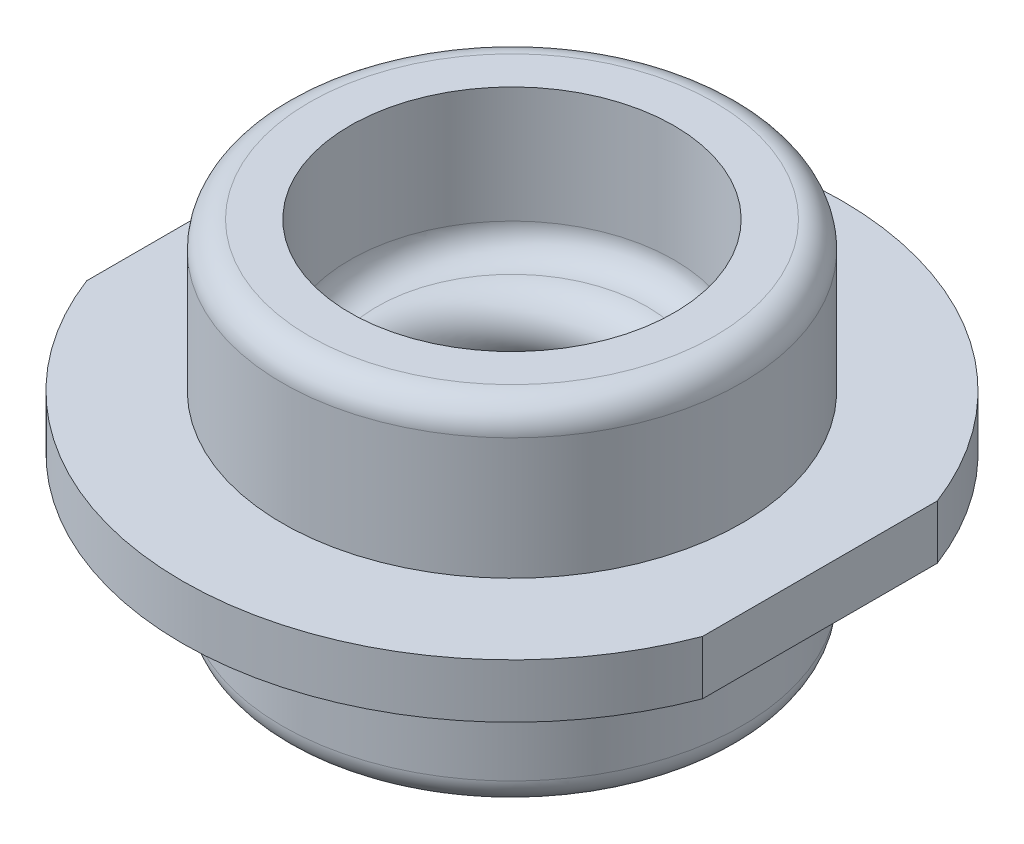
ISO-10303-21;
HEADER;
FILE_DESCRIPTION(('STEP AP214'),'2;1');
FILE_NAME('part.step','',(''),(''),'','','');
FILE_SCHEMA(('AUTOMOTIVE_DESIGN { 1 0 10303 214 1 1 1 1 }'));
ENDSEC;
DATA;
#1=APPLICATION_CONTEXT('core data for automotive mechanical design processes');
#2=APPLICATION_PROTOCOL_DEFINITION('international standard','automotive_design',2000,#1);
#3=PRODUCT_CONTEXT('',#1,'mechanical');
#4=PRODUCT('Part','Part','',(#3));
#5=PRODUCT_RELATED_PRODUCT_CATEGORY('part','',(#4));
#6=PRODUCT_DEFINITION_FORMATION('','',#4);
#7=PRODUCT_DEFINITION_CONTEXT('part definition',#1,'design');
#8=PRODUCT_DEFINITION('design','',#6,#7);
#9=PRODUCT_DEFINITION_SHAPE('','',#8);
#10=(LENGTH_UNIT() NAMED_UNIT(*) SI_UNIT(.MILLI.,.METRE.));
#11=(NAMED_UNIT(*) PLANE_ANGLE_UNIT() SI_UNIT($,.RADIAN.));
#12=(NAMED_UNIT(*) SI_UNIT($,.STERADIAN.) SOLID_ANGLE_UNIT());
#13=UNCERTAINTY_MEASURE_WITH_UNIT(LENGTH_MEASURE(1.E-05),#10,'distance_accuracy_value','');
#14=(GEOMETRIC_REPRESENTATION_CONTEXT(3) GLOBAL_UNCERTAINTY_ASSIGNED_CONTEXT((#13)) GLOBAL_UNIT_ASSIGNED_CONTEXT((#10,
#11,#12)) REPRESENTATION_CONTEXT('',''));
#15=CARTESIAN_POINT('',(0.,0.,0.));
#16=DIRECTION('',(0.,0.,1.));
#17=DIRECTION('',(1.,0.,0.));
#18=AXIS2_PLACEMENT_3D('',#15,#16,#17);
#19=CARTESIAN_POINT('',(0.,0.,0.));
#20=DIRECTION('',(0.,-1.,0.));
#21=DIRECTION('',(0.,0.,-1.));
#22=AXIS2_PLACEMENT_3D('',#19,#20,#21);
#23=CYLINDRICAL_SURFACE('',#22,1.5494);
#24=CARTESIAN_POINT('',(0.,0.127,0.));
#25=DIRECTION('',(0.,-1.,0.));
#26=DIRECTION('',(0.,0.,-1.));
#27=AXIS2_PLACEMENT_3D('',#24,#25,#26);
#28=CIRCLE('',#27,1.5494);
#29=CARTESIAN_POINT('',(-1.4478,0.127,-0.551829248952972));
#30=VERTEX_POINT('',#29);
#31=CARTESIAN_POINT('',(1.4478,0.127,-0.551829248952973));
#32=VERTEX_POINT('',#31);
#33=EDGE_CURVE('E95',#30,#32,#28,.T.);
#34=ORIENTED_EDGE('',*,*,#33,.T.);
#35=DIRECTION('',(0.,-1.,0.));
#36=VECTOR('',#35,1.);
#37=CARTESIAN_POINT('',(1.4478,0.,-0.551829248952973));
#38=LINE('',#37,#36);
#39=CARTESIAN_POINT('',(1.4478,-0.127,-0.551829248952971));
#40=VERTEX_POINT('',#39);
#41=EDGE_CURVE('E85',#32,#40,#38,.T.);
#42=ORIENTED_EDGE('',*,*,#41,.T.);
#43=CARTESIAN_POINT('',(0.,-0.127,0.));
#44=DIRECTION('',(0.,-1.,0.));
#45=DIRECTION('',(0.,0.,-1.));
#46=AXIS2_PLACEMENT_3D('',#43,#44,#45);
#47=CIRCLE('',#46,1.5494);
#48=CARTESIAN_POINT('',(-1.4478,-0.127,-0.551829248952973));
#49=VERTEX_POINT('',#48);
#50=EDGE_CURVE('E93',#49,#40,#47,.T.);
#51=ORIENTED_EDGE('',*,*,#50,.F.);
#52=DIRECTION('',(0.,-1.,0.));
#53=VECTOR('',#52,1.);
#54=CARTESIAN_POINT('',(-1.4478,0.,-0.551829248952971));
#55=LINE('',#54,#53);
#56=EDGE_CURVE('E67',#49,#30,#55,.F.);
#57=ORIENTED_EDGE('',*,*,#56,.T.);
#58=EDGE_LOOP('',(#34,#42,#51,#57));
#59=FACE_BOUND('',#58,.T.);
#60=ADVANCED_FACE('F44',(#59),#23,.T.);
#61=CARTESIAN_POINT('',(-1.0795,0.127,0.));
#62=DIRECTION('',(0.,-1.,0.));
#63=DIRECTION('',(0.,0.,-1.));
#64=AXIS2_PLACEMENT_3D('',#61,#62,#63);
#65=PLANE('',#64);
#66=CARTESIAN_POINT('',(1.4478,0.127,0.551829248952971));
#67=VERTEX_POINT('',#66);
#68=CARTESIAN_POINT('',(-1.4478,0.127,0.551829248952971));
#69=VERTEX_POINT('',#68);
#70=EDGE_CURVE('E101',#67,#69,#28,.T.);
#71=ORIENTED_EDGE('',*,*,#70,.F.);
#72=DIRECTION('',(0.,0.,-1.));
#73=VECTOR('',#72,1.);
#74=CARTESIAN_POINT('',(1.4478,0.127,0.));
#75=LINE('',#74,#73);
#76=EDGE_CURVE('E97',#67,#32,#75,.T.);
#77=ORIENTED_EDGE('',*,*,#76,.T.);
#78=ORIENTED_EDGE('',*,*,#33,.F.);
#79=DIRECTION('',(0.,0.,1.));
#80=VECTOR('',#79,1.);
#81=CARTESIAN_POINT('',(-1.4478,0.127,0.));
#82=LINE('',#81,#80);
#83=EDGE_CURVE('E158',#30,#69,#82,.T.);
#84=ORIENTED_EDGE('',*,*,#83,.T.);
#85=EDGE_LOOP('',(#71,#77,#78,#84));
#86=FACE_BOUND('',#85,.T.);
#87=CARTESIAN_POINT('',(0.,0.127,0.));
#88=DIRECTION('',(0.,-1.,0.));
#89=DIRECTION('',(0.,0.,-1.));
#90=AXIS2_PLACEMENT_3D('',#87,#88,#89);
#91=CIRCLE('',#90,1.0795);
#92=CARTESIAN_POINT('',(0.,0.127,-1.0795));
#93=VERTEX_POINT('',#92);
#94=EDGE_CURVE('E154',#93,#93,#91,.T.);
#95=ORIENTED_EDGE('',*,*,#94,.T.);
#96=EDGE_LOOP('',(#95));
#97=FACE_BOUND('',#96,.T.);
#98=ADVANCED_FACE('F208',(#86,#97),#65,.F.);
#99=CARTESIAN_POINT('',(1.4478,-0.127,0.55182924895297));
#100=VERTEX_POINT('',#99);
#101=CARTESIAN_POINT('',(-1.4478,-0.126999999999999,0.551829248952973));
#102=VERTEX_POINT('',#101);
#103=EDGE_CURVE('E102',#100,#102,#47,.T.);
#104=ORIENTED_EDGE('',*,*,#103,.F.);
#105=DIRECTION('',(0.,-1.,0.));
#106=VECTOR('',#105,1.);
#107=CARTESIAN_POINT('',(1.4478,0.,0.551829248952971));
#108=LINE('',#107,#106);
#109=EDGE_CURVE('E60',#100,#67,#108,.F.);
#110=ORIENTED_EDGE('',*,*,#109,.T.);
#111=ORIENTED_EDGE('',*,*,#70,.T.);
#112=DIRECTION('',(0.,-1.,0.));
#113=VECTOR('',#112,1.);
#114=CARTESIAN_POINT('',(-1.4478,0.,0.551829248952972));
#115=LINE('',#114,#113);
#116=EDGE_CURVE('E167',#69,#102,#115,.T.);
#117=ORIENTED_EDGE('',*,*,#116,.T.);
#118=EDGE_LOOP('',(#104,#110,#111,#117));
#119=FACE_BOUND('',#118,.T.);
#120=ADVANCED_FACE('F199',(#119),#23,.T.);
#121=CARTESIAN_POINT('',(-1.5494,-0.127,0.));
#122=DIRECTION('',(0.,1.,0.));
#123=DIRECTION('',(0.,0.,1.));
#124=AXIS2_PLACEMENT_3D('',#121,#122,#123);
#125=PLANE('',#124);
#126=CARTESIAN_POINT('',(0.,-0.127,0.));
#127=DIRECTION('',(0.,-1.,0.));
#128=DIRECTION('',(0.,0.,-1.));
#129=AXIS2_PLACEMENT_3D('',#126,#127,#128);
#130=CIRCLE('',#129,1.0795);
#131=CARTESIAN_POINT('',(0.,-0.127,-1.0795));
#132=VERTEX_POINT('',#131);
#133=EDGE_CURVE('E108',#132,#132,#130,.T.);
#134=ORIENTED_EDGE('',*,*,#133,.F.);
#135=EDGE_LOOP('',(#134));
#136=FACE_BOUND('',#135,.T.);
#137=ORIENTED_EDGE('',*,*,#50,.T.);
#138=DIRECTION('',(0.,0.,1.));
#139=VECTOR('',#138,1.);
#140=CARTESIAN_POINT('',(1.4478,-0.127,0.));
#141=LINE('',#140,#139);
#142=EDGE_CURVE('E11',#40,#100,#141,.T.);
#143=ORIENTED_EDGE('',*,*,#142,.T.);
#144=ORIENTED_EDGE('',*,*,#103,.T.);
#145=DIRECTION('',(0.,0.,-1.));
#146=VECTOR('',#145,1.);
#147=CARTESIAN_POINT('',(-1.4478,-0.127,0.));
#148=LINE('',#147,#146);
#149=EDGE_CURVE('E53',#102,#49,#148,.T.);
#150=ORIENTED_EDGE('',*,*,#149,.T.);
#151=EDGE_LOOP('',(#137,#143,#144,#150));
#152=FACE_BOUND('',#151,.T.);
#153=ADVANCED_FACE('F99',(#136,#152),#125,.F.);
#154=CARTESIAN_POINT('',(0.,0.,0.));
#155=DIRECTION('',(0.,-1.,0.));
#156=DIRECTION('',(0.,0.,-1.));
#157=AXIS2_PLACEMENT_3D('',#154,#155,#156);
#158=CYLINDRICAL_SURFACE('',#157,1.0795);
#159=CARTESIAN_POINT('',(0.,-0.698499999999999,0.));
#160=DIRECTION('',(0.,1.,0.));
#161=DIRECTION('',(0.,0.,1.));
#162=AXIS2_PLACEMENT_3D('',#159,#160,#161);
#163=CIRCLE('',#162,1.0795);
#164=CARTESIAN_POINT('',(0.,-0.698499999999999,1.0795));
#165=VERTEX_POINT('',#164);
#166=EDGE_CURVE('E117',#165,#165,#163,.T.);
#167=ORIENTED_EDGE('',*,*,#166,.T.);
#168=EDGE_LOOP('',(#167));
#169=FACE_BOUND('',#168,.T.);
#170=ORIENTED_EDGE('',*,*,#133,.T.);
#171=EDGE_LOOP('',(#170));
#172=FACE_BOUND('',#171,.T.);
#173=ADVANCED_FACE('F196',(#169,#172),#158,.T.);
#174=CARTESIAN_POINT('',(-1.0795,-0.825499999999999,0.));
#175=DIRECTION('',(0.,1.,0.));
#176=DIRECTION('',(0.,0.,1.));
#177=AXIS2_PLACEMENT_3D('',#174,#175,#176);
#178=PLANE('',#177);
#179=CARTESIAN_POINT('',(0.,-0.825499999999999,0.));
#180=DIRECTION('',(0.,1.,0.));
#181=DIRECTION('',(0.,0.,1.));
#182=AXIS2_PLACEMENT_3D('',#179,#180,#181);
#183=CIRCLE('',#182,0.9525);
#184=CARTESIAN_POINT('',(0.,-0.825499999999999,0.9525));
#185=VERTEX_POINT('',#184);
#186=EDGE_CURVE('E113',#185,#185,#183,.F.);
#187=ORIENTED_EDGE('',*,*,#186,.T.);
#188=EDGE_LOOP('',(#187));
#189=FACE_BOUND('',#188,.T.);
#190=CARTESIAN_POINT('',(0.,-0.825499999999999,0.));
#191=DIRECTION('',(0.,-1.,0.));
#192=DIRECTION('',(0.,0.,-1.));
#193=AXIS2_PLACEMENT_3D('',#190,#191,#192);
#194=CIRCLE('',#193,0.762);
#195=CARTESIAN_POINT('',(0.,-0.825499999999999,-0.762));
#196=VERTEX_POINT('',#195);
#197=EDGE_CURVE('E185',#196,#196,#194,.T.);
#198=ORIENTED_EDGE('',*,*,#197,.F.);
#199=EDGE_LOOP('',(#198));
#200=FACE_BOUND('',#199,.T.);
#201=ADVANCED_FACE('F205',(#189,#200),#178,.F.);
#202=CARTESIAN_POINT('',(0.,0.,0.));
#203=DIRECTION('',(0.,-1.,0.));
#204=DIRECTION('',(0.,0.,-1.));
#205=AXIS2_PLACEMENT_3D('',#202,#203,#204);
#206=CYLINDRICAL_SURFACE('',#205,0.762);
#207=CARTESIAN_POINT('',(0.,-0.279399999999999,0.));
#208=DIRECTION('',(0.,-1.,0.));
#209=DIRECTION('',(0.,0.,-1.));
#210=AXIS2_PLACEMENT_3D('',#207,#208,#209);
#211=CIRCLE('',#210,0.762);
#212=CARTESIAN_POINT('',(0.,-0.279399999999999,-0.762));
#213=VERTEX_POINT('',#212);
#214=EDGE_CURVE('E182',#213,#213,#211,.T.);
#215=ORIENTED_EDGE('',*,*,#214,.F.);
#216=EDGE_LOOP('',(#215));
#217=FACE_BOUND('',#216,.T.);
#218=ORIENTED_EDGE('',*,*,#197,.T.);
#219=EDGE_LOOP('',(#218));
#220=FACE_BOUND('',#219,.T.);
#221=ADVANCED_FACE('F227',(#217,#220),#206,.F.);
#222=CARTESIAN_POINT('',(0.,-0.279399999999999,0.));
#223=DIRECTION('',(0.,-1.,0.));
#224=DIRECTION('',(0.,0.,-1.));
#225=AXIS2_PLACEMENT_3D('',#222,#223,#224);
#226=TOROIDAL_SURFACE('',#225,0.635,0.127);
#227=CARTESIAN_POINT('',(0.,-0.152399999999999,0.));
#228=DIRECTION('',(0.,-1.,0.));
#229=DIRECTION('',(0.,0.,-1.));
#230=AXIS2_PLACEMENT_3D('',#227,#228,#229);
#231=CIRCLE('',#230,0.635);
#232=CARTESIAN_POINT('',(0.,-0.152399999999999,-0.635));
#233=VERTEX_POINT('',#232);
#234=EDGE_CURVE('E178',#233,#233,#231,.T.);
#235=ORIENTED_EDGE('',*,*,#234,.F.);
#236=EDGE_LOOP('',(#235));
#237=FACE_BOUND('',#236,.T.);
#238=ORIENTED_EDGE('',*,*,#214,.T.);
#239=EDGE_LOOP('',(#238));
#240=FACE_BOUND('',#239,.T.);
#241=ADVANCED_FACE('F232',(#237,#240),#226,.F.);
#242=CARTESIAN_POINT('',(0.,0.,0.));
#243=DIRECTION('',(0.,-1.,0.));
#244=DIRECTION('',(0.,0.,-1.));
#245=AXIS2_PLACEMENT_3D('',#242,#243,#244);
#246=TOROIDAL_SURFACE('',#245,0.635,0.1524);
#247=CARTESIAN_POINT('',(0.,0.1524,0.));
#248=DIRECTION('',(0.,-1.,0.));
#249=DIRECTION('',(0.,0.,-1.));
#250=AXIS2_PLACEMENT_3D('',#247,#248,#249);
#251=CIRCLE('',#250,0.635);
#252=CARTESIAN_POINT('',(0.,0.1524,-0.635));
#253=VERTEX_POINT('',#252);
#254=EDGE_CURVE('E174',#253,#253,#251,.T.);
#255=ORIENTED_EDGE('',*,*,#254,.F.);
#256=EDGE_LOOP('',(#255));
#257=FACE_BOUND('',#256,.T.);
#258=ORIENTED_EDGE('',*,*,#234,.T.);
#259=EDGE_LOOP('',(#258));
#260=FACE_BOUND('',#259,.T.);
#261=ADVANCED_FACE('F238',(#257,#260),#246,.T.);
#262=CARTESIAN_POINT('',(0.,0.279400000000001,0.));
#263=DIRECTION('',(0.,-1.,0.));
#264=DIRECTION('',(0.,0.,-1.));
#265=AXIS2_PLACEMENT_3D('',#262,#263,#264);
#266=TOROIDAL_SURFACE('',#265,0.635,0.127);
#267=CARTESIAN_POINT('',(0.,0.279400000000001,0.));
#268=DIRECTION('',(0.,-1.,0.));
#269=DIRECTION('',(0.,0.,-1.));
#270=AXIS2_PLACEMENT_3D('',#267,#268,#269);
#271=CIRCLE('',#270,0.762);
#272=CARTESIAN_POINT('',(0.,0.279400000000001,-0.762));
#273=VERTEX_POINT('',#272);
#274=EDGE_CURVE('E164',#273,#273,#271,.T.);
#275=ORIENTED_EDGE('',*,*,#274,.F.);
#276=EDGE_LOOP('',(#275));
#277=FACE_BOUND('',#276,.T.);
#278=ORIENTED_EDGE('',*,*,#254,.T.);
#279=EDGE_LOOP('',(#278));
#280=FACE_BOUND('',#279,.T.);
#281=ADVANCED_FACE('F242',(#277,#280),#266,.F.);
#282=CARTESIAN_POINT('',(0.,0.,0.));
#283=DIRECTION('',(0.,-1.,0.));
#284=DIRECTION('',(0.,0.,-1.));
#285=AXIS2_PLACEMENT_3D('',#282,#283,#284);
#286=CYLINDRICAL_SURFACE('',#285,0.762);
#287=CARTESIAN_POINT('',(0.,0.8255,0.));
#288=DIRECTION('',(0.,-1.,0.));
#289=DIRECTION('',(0.,0.,-1.));
#290=AXIS2_PLACEMENT_3D('',#287,#288,#289);
#291=CIRCLE('',#290,0.762);
#292=CARTESIAN_POINT('',(0.,0.8255,-0.762));
#293=VERTEX_POINT('',#292);
#294=EDGE_CURVE('E157',#293,#293,#291,.T.);
#295=ORIENTED_EDGE('',*,*,#294,.F.);
#296=EDGE_LOOP('',(#295));
#297=FACE_BOUND('',#296,.T.);
#298=ORIENTED_EDGE('',*,*,#274,.T.);
#299=EDGE_LOOP('',(#298));
#300=FACE_BOUND('',#299,.T.);
#301=ADVANCED_FACE('F246',(#297,#300),#286,.F.);
#302=CARTESIAN_POINT('',(-0.762000000000001,0.8255,0.));
#303=DIRECTION('',(0.,-1.,0.));
#304=DIRECTION('',(0.,0.,-1.));
#305=AXIS2_PLACEMENT_3D('',#302,#303,#304);
#306=PLANE('',#305);
#307=CARTESIAN_POINT('',(0.,0.8255,0.));
#308=DIRECTION('',(0.,-1.,0.));
#309=DIRECTION('',(0.,0.,-1.));
#310=AXIS2_PLACEMENT_3D('',#307,#308,#309);
#311=CIRCLE('',#310,0.9525);
#312=CARTESIAN_POINT('',(0.,0.8255,-0.952500000000001));
#313=VERTEX_POINT('',#312);
#314=EDGE_CURVE('E125',#313,#313,#311,.F.);
#315=ORIENTED_EDGE('',*,*,#314,.T.);
#316=EDGE_LOOP('',(#315));
#317=FACE_BOUND('',#316,.T.);
#318=ORIENTED_EDGE('',*,*,#294,.T.);
#319=EDGE_LOOP('',(#318));
#320=FACE_BOUND('',#319,.T.);
#321=ADVANCED_FACE('F139',(#317,#320),#306,.F.);
#322=CARTESIAN_POINT('',(0.,0.,0.));
#323=DIRECTION('',(0.,-1.,0.));
#324=DIRECTION('',(0.,0.,-1.));
#325=AXIS2_PLACEMENT_3D('',#322,#323,#324);
#326=CYLINDRICAL_SURFACE('',#325,1.0795);
#327=CARTESIAN_POINT('',(0.,0.698499999999999,0.));
#328=DIRECTION('',(0.,-1.,0.));
#329=DIRECTION('',(0.,0.,-1.));
#330=AXIS2_PLACEMENT_3D('',#327,#328,#329);
#331=CIRCLE('',#330,1.0795);
#332=CARTESIAN_POINT('',(0.,0.698499999999999,-1.0795));
#333=VERTEX_POINT('',#332);
#334=EDGE_CURVE('E121',#333,#333,#331,.T.);
#335=ORIENTED_EDGE('',*,*,#334,.T.);
#336=EDGE_LOOP('',(#335));
#337=FACE_BOUND('',#336,.T.);
#338=ORIENTED_EDGE('',*,*,#94,.F.);
#339=EDGE_LOOP('',(#338));
#340=FACE_BOUND('',#339,.T.);
#341=ADVANCED_FACE('F148',(#337,#340),#326,.T.);
#342=CARTESIAN_POINT('',(0.,-0.698499999999999,0.));
#343=DIRECTION('',(0.,1.,0.));
#344=DIRECTION('',(0.,0.,1.));
#345=AXIS2_PLACEMENT_3D('',#342,#343,#344);
#346=TOROIDAL_SURFACE('',#345,0.9525,0.127);
#347=ORIENTED_EDGE('',*,*,#166,.F.);
#348=EDGE_LOOP('',(#347));
#349=FACE_BOUND('',#348,.T.);
#350=ORIENTED_EDGE('',*,*,#186,.F.);
#351=EDGE_LOOP('',(#350));
#352=FACE_BOUND('',#351,.T.);
#353=ADVANCED_FACE('F145',(#349,#352),#346,.T.);
#354=CARTESIAN_POINT('',(0.,0.698499999999999,0.));
#355=DIRECTION('',(0.,-1.,0.));
#356=DIRECTION('',(0.,0.,-1.));
#357=AXIS2_PLACEMENT_3D('',#354,#355,#356);
#358=TOROIDAL_SURFACE('',#357,0.9525,0.127);
#359=ORIENTED_EDGE('',*,*,#314,.F.);
#360=EDGE_LOOP('',(#359));
#361=FACE_BOUND('',#360,.T.);
#362=ORIENTED_EDGE('',*,*,#334,.F.);
#363=EDGE_LOOP('',(#362));
#364=FACE_BOUND('',#363,.T.);
#365=ADVANCED_FACE('F46',(#361,#364),#358,.T.);
#366=CARTESIAN_POINT('',(-1.4478,-1.27,-1.45355582063748));
#367=DIRECTION('',(1.,0.,0.));
#368=DIRECTION('',(0.,0.,-1.));
#369=AXIS2_PLACEMENT_3D('',#366,#367,#368);
#370=PLANE('',#369);
#371=ORIENTED_EDGE('',*,*,#56,.F.);
#372=ORIENTED_EDGE('',*,*,#149,.F.);
#373=ORIENTED_EDGE('',*,*,#116,.F.);
#374=ORIENTED_EDGE('',*,*,#83,.F.);
#375=EDGE_LOOP('',(#371,#372,#373,#374));
#376=FACE_BOUND('',#375,.T.);
#377=ADVANCED_FACE('F144',(#376),#370,.F.);
#378=CARTESIAN_POINT('',(1.4478,-1.27,-1.45355582063748));
#379=DIRECTION('',(-1.,0.,0.));
#380=DIRECTION('',(0.,0.,1.));
#381=AXIS2_PLACEMENT_3D('',#378,#379,#380);
#382=PLANE('',#381);
#383=ORIENTED_EDGE('',*,*,#109,.F.);
#384=ORIENTED_EDGE('',*,*,#142,.F.);
#385=ORIENTED_EDGE('',*,*,#41,.F.);
#386=ORIENTED_EDGE('',*,*,#76,.F.);
#387=EDGE_LOOP('',(#383,#384,#385,#386));
#388=FACE_BOUND('',#387,.T.);
#389=ADVANCED_FACE('F84',(#388),#382,.F.);
#390=CLOSED_SHELL('',(#60,#98,#120,#153,#173,#201,#221,#241,#261,#281,#301,#321,#341,#353,#365,
#377,#389));
#391=MANIFOLD_SOLID_BREP('B2',#390);
#392=ADVANCED_BREP_SHAPE_REPRESENTATION('',(#18,#391),#14);
#393=SHAPE_DEFINITION_REPRESENTATION(#9,#392);
ENDSEC;
END-ISO-10303-21;
